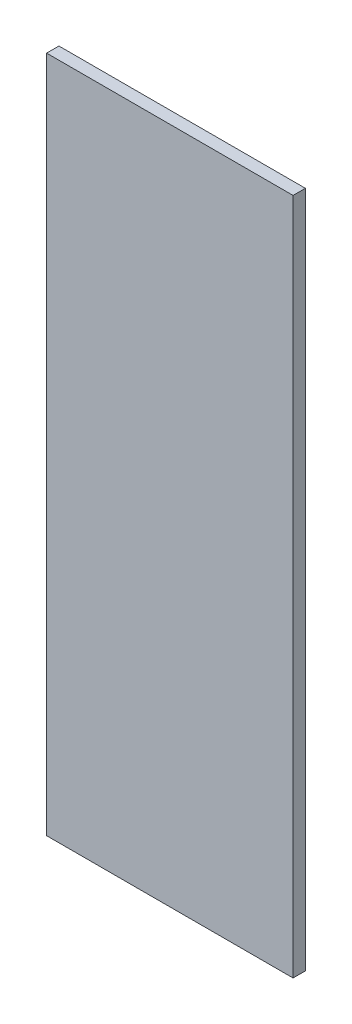
ISO-10303-21;
HEADER;
FILE_DESCRIPTION(('STEP AP214'),'2;1');
FILE_NAME('part.step','',(''),(''),'','','');
FILE_SCHEMA(('AUTOMOTIVE_DESIGN { 1 0 10303 214 1 1 1 1 }'));
ENDSEC;
DATA;
#1=APPLICATION_CONTEXT('core data for automotive mechanical design processes');
#2=APPLICATION_PROTOCOL_DEFINITION('international standard','automotive_design',2000,#1);
#3=PRODUCT_CONTEXT('',#1,'mechanical');
#4=PRODUCT('Part','Part','',(#3));
#5=PRODUCT_RELATED_PRODUCT_CATEGORY('part','',(#4));
#6=PRODUCT_DEFINITION_FORMATION('','',#4);
#7=PRODUCT_DEFINITION_CONTEXT('part definition',#1,'design');
#8=PRODUCT_DEFINITION('design','',#6,#7);
#9=PRODUCT_DEFINITION_SHAPE('','',#8);
#10=(LENGTH_UNIT() NAMED_UNIT(*) SI_UNIT(.MILLI.,.METRE.));
#11=(NAMED_UNIT(*) PLANE_ANGLE_UNIT() SI_UNIT($,.RADIAN.));
#12=(NAMED_UNIT(*) SI_UNIT($,.STERADIAN.) SOLID_ANGLE_UNIT());
#13=UNCERTAINTY_MEASURE_WITH_UNIT(LENGTH_MEASURE(1.E-05),#10,'distance_accuracy_value','');
#14=(GEOMETRIC_REPRESENTATION_CONTEXT(3) GLOBAL_UNCERTAINTY_ASSIGNED_CONTEXT((#13)) GLOBAL_UNIT_ASSIGNED_CONTEXT((#10,
#11,#12)) REPRESENTATION_CONTEXT('',''));
#15=CARTESIAN_POINT('',(0.,0.,0.));
#16=DIRECTION('',(0.,0.,1.));
#17=DIRECTION('',(1.,0.,0.));
#18=AXIS2_PLACEMENT_3D('',#15,#16,#17);
#19=CARTESIAN_POINT('',(50.,-137.5,5.));
#20=DIRECTION('',(-1.,0.,0.));
#21=DIRECTION('',(0.,0.,1.));
#22=AXIS2_PLACEMENT_3D('',#19,#20,#21);
#23=PLANE('',#22);
#24=DIRECTION('',(0.,1.,0.));
#25=VECTOR('',#24,1.);
#26=CARTESIAN_POINT('',(50.,-137.5,0.));
#27=LINE('',#26,#25);
#28=CARTESIAN_POINT('',(50.,-137.5,0.));
#29=VERTEX_POINT('',#28);
#30=CARTESIAN_POINT('',(50.,137.5,0.));
#31=VERTEX_POINT('',#30);
#32=EDGE_CURVE('E98',#29,#31,#27,.T.);
#33=ORIENTED_EDGE('',*,*,#32,.T.);
#34=DIRECTION('',(0.,0.,-1.));
#35=VECTOR('',#34,1.);
#36=CARTESIAN_POINT('',(50.,137.5,5.));
#37=LINE('',#36,#35);
#38=CARTESIAN_POINT('',(50.,137.5,5.));
#39=VERTEX_POINT('',#38);
#40=EDGE_CURVE('E11',#39,#31,#37,.T.);
#41=ORIENTED_EDGE('',*,*,#40,.F.);
#42=DIRECTION('',(0.,1.,0.));
#43=VECTOR('',#42,1.);
#44=CARTESIAN_POINT('',(50.,-137.5,5.));
#45=LINE('',#44,#43);
#46=CARTESIAN_POINT('',(50.,-137.5,5.));
#47=VERTEX_POINT('',#46);
#48=EDGE_CURVE('E86',#47,#39,#45,.T.);
#49=ORIENTED_EDGE('',*,*,#48,.F.);
#50=DIRECTION('',(0.,0.,-1.));
#51=VECTOR('',#50,1.);
#52=CARTESIAN_POINT('',(50.,-137.5,5.));
#53=LINE('',#52,#51);
#54=EDGE_CURVE('E94',#47,#29,#53,.T.);
#55=ORIENTED_EDGE('',*,*,#54,.T.);
#56=EDGE_LOOP('',(#33,#41,#49,#55));
#57=FACE_BOUND('',#56,.T.);
#58=ADVANCED_FACE('F35',(#57),#23,.F.);
#59=CARTESIAN_POINT('',(-50.,137.5,5.));
#60=DIRECTION('',(0.,-1.,0.));
#61=DIRECTION('',(0.,0.,-1.));
#62=AXIS2_PLACEMENT_3D('',#59,#60,#61);
#63=PLANE('',#62);
#64=DIRECTION('',(-1.,0.,0.));
#65=VECTOR('',#64,1.);
#66=CARTESIAN_POINT('',(-50.,137.5,0.));
#67=LINE('',#66,#65);
#68=CARTESIAN_POINT('',(-50.,137.5,0.));
#69=VERTEX_POINT('',#68);
#70=EDGE_CURVE('E90',#31,#69,#67,.T.);
#71=ORIENTED_EDGE('',*,*,#70,.T.);
#72=DIRECTION('',(0.,0.,-1.));
#73=VECTOR('',#72,1.);
#74=CARTESIAN_POINT('',(-50.,137.5,5.));
#75=LINE('',#74,#73);
#76=CARTESIAN_POINT('',(-50.,137.5,5.));
#77=VERTEX_POINT('',#76);
#78=EDGE_CURVE('E43',#77,#69,#75,.T.);
#79=ORIENTED_EDGE('',*,*,#78,.F.);
#80=DIRECTION('',(-1.,0.,0.));
#81=VECTOR('',#80,1.);
#82=CARTESIAN_POINT('',(-50.,137.5,5.));
#83=LINE('',#82,#81);
#84=EDGE_CURVE('E81',#39,#77,#83,.T.);
#85=ORIENTED_EDGE('',*,*,#84,.F.);
#86=ORIENTED_EDGE('',*,*,#40,.T.);
#87=EDGE_LOOP('',(#71,#79,#85,#86));
#88=FACE_BOUND('',#87,.T.);
#89=ADVANCED_FACE('F89',(#88),#63,.F.);
#90=CARTESIAN_POINT('',(-50.,-137.5,5.));
#91=DIRECTION('',(1.,0.,0.));
#92=DIRECTION('',(0.,0.,-1.));
#93=AXIS2_PLACEMENT_3D('',#90,#91,#92);
#94=PLANE('',#93);
#95=DIRECTION('',(0.,-1.,0.));
#96=VECTOR('',#95,1.);
#97=CARTESIAN_POINT('',(-50.,-137.5,0.));
#98=LINE('',#97,#96);
#99=CARTESIAN_POINT('',(-50.,-137.5,0.));
#100=VERTEX_POINT('',#99);
#101=EDGE_CURVE('E68',#69,#100,#98,.T.);
#102=ORIENTED_EDGE('',*,*,#101,.T.);
#103=DIRECTION('',(0.,0.,-1.));
#104=VECTOR('',#103,1.);
#105=CARTESIAN_POINT('',(-50.,-137.5,5.));
#106=LINE('',#105,#104);
#107=CARTESIAN_POINT('',(-50.,-137.5,5.));
#108=VERTEX_POINT('',#107);
#109=EDGE_CURVE('E91',#108,#100,#106,.T.);
#110=ORIENTED_EDGE('',*,*,#109,.F.);
#111=DIRECTION('',(0.,-1.,0.));
#112=VECTOR('',#111,1.);
#113=CARTESIAN_POINT('',(-50.,-137.5,5.));
#114=LINE('',#113,#112);
#115=EDGE_CURVE('E84',#77,#108,#114,.T.);
#116=ORIENTED_EDGE('',*,*,#115,.F.);
#117=ORIENTED_EDGE('',*,*,#78,.T.);
#118=EDGE_LOOP('',(#102,#110,#116,#117));
#119=FACE_BOUND('',#118,.T.);
#120=ADVANCED_FACE('F92',(#119),#94,.F.);
#121=CARTESIAN_POINT('',(-50.,-137.5,5.));
#122=DIRECTION('',(0.,1.,0.));
#123=DIRECTION('',(0.,0.,1.));
#124=AXIS2_PLACEMENT_3D('',#121,#122,#123);
#125=PLANE('',#124);
#126=DIRECTION('',(1.,0.,0.));
#127=VECTOR('',#126,1.);
#128=CARTESIAN_POINT('',(-50.,-137.5,0.));
#129=LINE('',#128,#127);
#130=EDGE_CURVE('E74',#100,#29,#129,.T.);
#131=ORIENTED_EDGE('',*,*,#130,.T.);
#132=ORIENTED_EDGE('',*,*,#54,.F.);
#133=DIRECTION('',(1.,0.,0.));
#134=VECTOR('',#133,1.);
#135=CARTESIAN_POINT('',(-50.,-137.5,5.));
#136=LINE('',#135,#134);
#137=EDGE_CURVE('E51',#108,#47,#136,.T.);
#138=ORIENTED_EDGE('',*,*,#137,.F.);
#139=ORIENTED_EDGE('',*,*,#109,.T.);
#140=EDGE_LOOP('',(#131,#132,#138,#139));
#141=FACE_BOUND('',#140,.T.);
#142=ADVANCED_FACE('F105',(#141),#125,.F.);
#143=CARTESIAN_POINT('',(0.,0.,5.));
#144=DIRECTION('',(0.,0.,-1.));
#145=DIRECTION('',(-1.,0.,0.));
#146=AXIS2_PLACEMENT_3D('',#143,#144,#145);
#147=PLANE('',#146);
#148=ORIENTED_EDGE('',*,*,#48,.T.);
#149=ORIENTED_EDGE('',*,*,#84,.T.);
#150=ORIENTED_EDGE('',*,*,#115,.T.);
#151=ORIENTED_EDGE('',*,*,#137,.T.);
#152=EDGE_LOOP('',(#148,#149,#150,#151));
#153=FACE_BOUND('',#152,.T.);
#154=ADVANCED_FACE('F82',(#153),#147,.F.);
#155=CARTESIAN_POINT('',(0.,0.,0.));
#156=DIRECTION('',(0.,0.,-1.));
#157=DIRECTION('',(-1.,0.,0.));
#158=AXIS2_PLACEMENT_3D('',#155,#156,#157);
#159=PLANE('',#158);
#160=ORIENTED_EDGE('',*,*,#32,.F.);
#161=ORIENTED_EDGE('',*,*,#130,.F.);
#162=ORIENTED_EDGE('',*,*,#101,.F.);
#163=ORIENTED_EDGE('',*,*,#70,.F.);
#164=EDGE_LOOP('',(#160,#161,#162,#163));
#165=FACE_BOUND('',#164,.T.);
#166=ADVANCED_FACE('F108',(#165),#159,.T.);
#167=CLOSED_SHELL('',(#58,#89,#120,#142,#154,#166));
#168=MANIFOLD_SOLID_BREP('B2',#167);
#169=ADVANCED_BREP_SHAPE_REPRESENTATION('',(#18,#168),#14);
#170=SHAPE_DEFINITION_REPRESENTATION(#9,#169);
ENDSEC;
END-ISO-10303-21;
